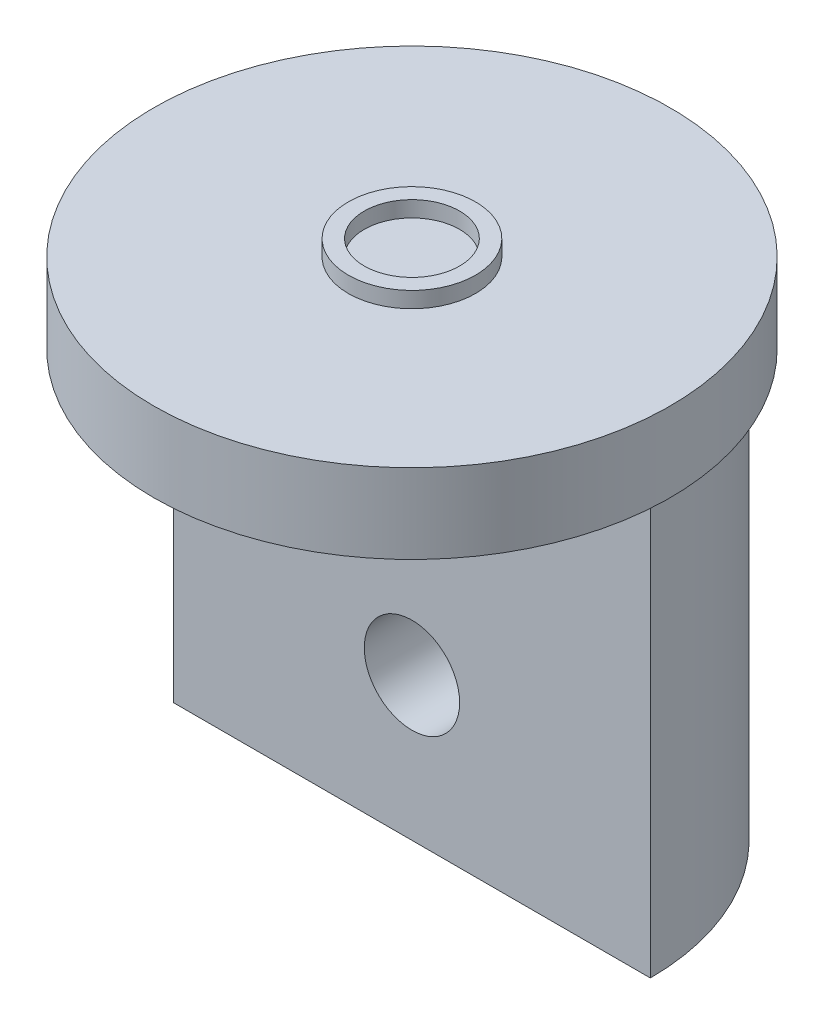
ISO-10303-21;
HEADER;
FILE_DESCRIPTION(('STEP AP214'),'2;1');
FILE_NAME('part.step','',(''),(''),'','','');
FILE_SCHEMA(('AUTOMOTIVE_DESIGN { 1 0 10303 214 1 1 1 1 }'));
ENDSEC;
DATA;
#1=APPLICATION_CONTEXT('core data for automotive mechanical design processes');
#2=APPLICATION_PROTOCOL_DEFINITION('international standard','automotive_design',2000,#1);
#3=PRODUCT_CONTEXT('',#1,'mechanical');
#4=PRODUCT('Part','Part','',(#3));
#5=PRODUCT_RELATED_PRODUCT_CATEGORY('part','',(#4));
#6=PRODUCT_DEFINITION_FORMATION('','',#4);
#7=PRODUCT_DEFINITION_CONTEXT('part definition',#1,'design');
#8=PRODUCT_DEFINITION('design','',#6,#7);
#9=PRODUCT_DEFINITION_SHAPE('','',#8);
#10=(LENGTH_UNIT() NAMED_UNIT(*) SI_UNIT(.MILLI.,.METRE.));
#11=(NAMED_UNIT(*) PLANE_ANGLE_UNIT() SI_UNIT($,.RADIAN.));
#12=(NAMED_UNIT(*) SI_UNIT($,.STERADIAN.) SOLID_ANGLE_UNIT());
#13=UNCERTAINTY_MEASURE_WITH_UNIT(LENGTH_MEASURE(1.E-05),#10,'distance_accuracy_value','');
#14=(GEOMETRIC_REPRESENTATION_CONTEXT(3) GLOBAL_UNCERTAINTY_ASSIGNED_CONTEXT((#13)) GLOBAL_UNIT_ASSIGNED_CONTEXT((#10,
#11,#12)) REPRESENTATION_CONTEXT('',''));
#15=CARTESIAN_POINT('',(0.,0.,0.));
#16=DIRECTION('',(0.,0.,1.));
#17=DIRECTION('',(1.,0.,0.));
#18=AXIS2_PLACEMENT_3D('',#15,#16,#17);
#19=CARTESIAN_POINT('',(0.,-63.5872,0.));
#20=DIRECTION('',(0.,0.,-1.));
#21=DIRECTION('',(-1.,0.,0.));
#22=AXIS2_PLACEMENT_3D('',#19,#20,#21);
#23=PLANE('',#22);
#24=CARTESIAN_POINT('',(0.,-45.5872,0.));
#25=DIRECTION('',(0.,0.,1.));
#26=DIRECTION('',(1.,0.,0.));
#27=AXIS2_PLACEMENT_3D('',#24,#25,#26);
#28=CIRCLE('',#27,6.);
#29=CARTESIAN_POINT('',(6.,-45.5872,0.));
#30=VERTEX_POINT('',#29);
#31=EDGE_CURVE('E93',#30,#30,#28,.T.);
#32=ORIENTED_EDGE('',*,*,#31,.F.);
#33=EDGE_LOOP('',(#32));
#34=FACE_BOUND('',#33,.T.);
#35=DIRECTION('',(-1.,0.,0.));
#36=VECTOR('',#35,1.);
#37=CARTESIAN_POINT('',(0.,-10.,0.));
#38=LINE('',#37,#36);
#39=CARTESIAN_POINT('',(30.,-10.,0.));
#40=VERTEX_POINT('',#39);
#41=CARTESIAN_POINT('',(-30.,-10.,0.));
#42=VERTEX_POINT('',#41);
#43=EDGE_CURVE('E57',#40,#42,#38,.T.);
#44=ORIENTED_EDGE('',*,*,#43,.T.);
#45=DIRECTION('',(0.,1.,0.));
#46=VECTOR('',#45,1.);
#47=CARTESIAN_POINT('',(-30.,-63.5872,0.));
#48=LINE('',#47,#46);
#49=CARTESIAN_POINT('',(-30.,-63.5872,0.));
#50=VERTEX_POINT('',#49);
#51=EDGE_CURVE('E74',#50,#42,#48,.T.);
#52=ORIENTED_EDGE('',*,*,#51,.F.);
#53=DIRECTION('',(-1.,0.,0.));
#54=VECTOR('',#53,1.);
#55=CARTESIAN_POINT('',(0.,-63.5872,0.));
#56=LINE('',#55,#54);
#57=CARTESIAN_POINT('',(30.,-63.5872,0.));
#58=VERTEX_POINT('',#57);
#59=EDGE_CURVE('E64',#58,#50,#56,.T.);
#60=ORIENTED_EDGE('',*,*,#59,.F.);
#61=DIRECTION('',(0.,1.,0.));
#62=VECTOR('',#61,1.);
#63=CARTESIAN_POINT('',(30.,-63.5872,0.));
#64=LINE('',#63,#62);
#65=EDGE_CURVE('E69',#58,#40,#64,.T.);
#66=ORIENTED_EDGE('',*,*,#65,.T.);
#67=EDGE_LOOP('',(#44,#52,#60,#66));
#68=FACE_BOUND('',#67,.T.);
#69=ADVANCED_FACE('F41',(#34,#68),#23,.F.);
#70=CARTESIAN_POINT('',(0.,-10.,0.));
#71=DIRECTION('',(0.,1.,0.));
#72=DIRECTION('',(0.,0.,1.));
#73=AXIS2_PLACEMENT_3D('',#70,#71,#72);
#74=CYLINDRICAL_SURFACE('',#73,32.5);
#75=CARTESIAN_POINT('',(0.,-10.,0.));
#76=DIRECTION('',(0.,1.,0.));
#77=DIRECTION('',(0.,0.,1.));
#78=AXIS2_PLACEMENT_3D('',#75,#76,#77);
#79=CIRCLE('',#78,32.5);
#80=CARTESIAN_POINT('',(0.,-10.,32.5));
#81=VERTEX_POINT('',#80);
#82=EDGE_CURVE('E50',#81,#81,#79,.T.);
#83=ORIENTED_EDGE('',*,*,#82,.T.);
#84=EDGE_LOOP('',(#83));
#85=FACE_BOUND('',#84,.T.);
#86=CARTESIAN_POINT('',(0.,0.,0.));
#87=DIRECTION('',(0.,1.,0.));
#88=DIRECTION('',(0.,0.,1.));
#89=AXIS2_PLACEMENT_3D('',#86,#87,#88);
#90=CIRCLE('',#89,32.5);
#91=CARTESIAN_POINT('',(0.,0.,32.5));
#92=VERTEX_POINT('',#91);
#93=EDGE_CURVE('E82',#92,#92,#90,.T.);
#94=ORIENTED_EDGE('',*,*,#93,.F.);
#95=EDGE_LOOP('',(#94));
#96=FACE_BOUND('',#95,.T.);
#97=ADVANCED_FACE('F43',(#85,#96),#74,.T.);
#98=CARTESIAN_POINT('',(0.,-10.,0.));
#99=DIRECTION('',(0.,1.,0.));
#100=DIRECTION('',(0.,0.,1.));
#101=AXIS2_PLACEMENT_3D('',#98,#99,#100);
#102=PLANE('',#101);
#103=CARTESIAN_POINT('',(0.,-10.,0.));
#104=DIRECTION('',(0.,1.,0.));
#105=DIRECTION('',(0.,0.,1.));
#106=AXIS2_PLACEMENT_3D('',#103,#104,#105);
#107=CIRCLE('',#106,30.);
#108=EDGE_CURVE('E78',#40,#42,#107,.T.);
#109=ORIENTED_EDGE('',*,*,#108,.T.);
#110=ORIENTED_EDGE('',*,*,#43,.F.);
#111=EDGE_LOOP('',(#109,#110));
#112=FACE_BOUND('',#111,.T.);
#113=ORIENTED_EDGE('',*,*,#82,.F.);
#114=EDGE_LOOP('',(#113));
#115=FACE_BOUND('',#114,.T.);
#116=ADVANCED_FACE('F84',(#112,#115),#102,.F.);
#117=CARTESIAN_POINT('',(0.,0.,0.));
#118=DIRECTION('',(0.,1.,0.));
#119=DIRECTION('',(0.,0.,1.));
#120=AXIS2_PLACEMENT_3D('',#117,#118,#119);
#121=PLANE('',#120);
#122=CARTESIAN_POINT('',(0.,0.,0.));
#123=DIRECTION('',(0.,1.,0.));
#124=DIRECTION('',(0.,0.,1.));
#125=AXIS2_PLACEMENT_3D('',#122,#123,#124);
#126=CIRCLE('',#125,8.);
#127=CARTESIAN_POINT('',(0.,0.,8.));
#128=VERTEX_POINT('',#127);
#129=EDGE_CURVE('E173',#128,#128,#126,.T.);
#130=ORIENTED_EDGE('',*,*,#129,.F.);
#131=EDGE_LOOP('',(#130));
#132=FACE_BOUND('',#131,.T.);
#133=ORIENTED_EDGE('',*,*,#93,.T.);
#134=EDGE_LOOP('',(#133));
#135=FACE_BOUND('',#134,.T.);
#136=ADVANCED_FACE('F127',(#132,#135),#121,.T.);
#137=CARTESIAN_POINT('',(0.,-63.5872,0.));
#138=DIRECTION('',(0.,1.,0.));
#139=DIRECTION('',(0.,0.,1.));
#140=AXIS2_PLACEMENT_3D('',#137,#138,#139);
#141=CYLINDRICAL_SURFACE('',#140,30.);
#142=CARTESIAN_POINT('',(6.,-45.5872,-29.3938769133981));
#143=CARTESIAN_POINT('',(6.00000333510614,-45.7539491317261,-29.393875096905));
#144=CARTESIAN_POINT('',(5.99304686885587,-45.9206566269355,-29.3952984818504));
#145=CARTESIAN_POINT('',(5.96528300149183,-46.2529163846163,-29.4009458431103));
#146=CARTESIAN_POINT('',(5.94447325865162,-46.4184684469945,-29.40517029291));
#147=CARTESIAN_POINT('',(5.88914931201488,-46.7472569582242,-29.4163000801468));
#148=CARTESIAN_POINT('',(5.85462796382056,-46.9104921538809,-29.4232068151401));
#149=CARTESIAN_POINT('',(5.7721394346217,-47.2334667131942,-29.4395002230684));
#150=CARTESIAN_POINT('',(5.72416730423297,-47.3932047666639,-29.4488878087902));
#151=CARTESIAN_POINT('',(5.61522748795583,-47.7077873685409,-29.4698539103105));
#152=CARTESIAN_POINT('',(5.5542778349152,-47.8626383683656,-29.4814293834603));
#153=CARTESIAN_POINT('',(5.41977382716697,-48.1666756496078,-29.5064523391392));
#154=CARTESIAN_POINT('',(5.34621482271147,-48.3158598164792,-29.5199005118891));
#155=CARTESIAN_POINT('',(5.18707511068997,-48.6074360065465,-29.54827876595));
#156=CARTESIAN_POINT('',(5.10149974711649,-48.7498310115571,-29.5632081876493));
#157=CARTESIAN_POINT('',(4.91886856337343,-49.0270093650341,-29.594143163833));
#158=CARTESIAN_POINT('',(4.82180845652764,-49.1617898434732,-29.6101491191652));
#159=CARTESIAN_POINT('',(4.61563131912603,-49.4244071485701,-29.6429919960716));
#160=CARTESIAN_POINT('',(4.50638045208952,-49.5521379432488,-29.659836726956));
#161=CARTESIAN_POINT('',(4.27752319485129,-49.798021148447,-29.6937060209025));
#162=CARTESIAN_POINT('',(4.15791298163718,-49.916169991429,-29.7107306483011));
#163=CARTESIAN_POINT('',(3.9092158779844,-50.1420035291532,-29.7444746075582));
#164=CARTESIAN_POINT('',(3.78013179944656,-50.24969130693,-29.761194028179));
#165=CARTESIAN_POINT('',(3.51327430785834,-50.4539388486554,-29.793874835481));
#166=CARTESIAN_POINT('',(3.37549771025503,-50.550494497227,-29.8098359405508));
#167=CARTESIAN_POINT('',(3.09103878904664,-50.7325111258314,-29.8406787849013));
#168=CARTESIAN_POINT('',(2.94429156962211,-50.8178724654346,-29.8555503702572));
#169=CARTESIAN_POINT('',(2.64391411223831,-50.9759417022605,-29.8836491327882));
#170=CARTESIAN_POINT('',(2.49028131943708,-51.0486448530539,-29.8968756926008));
#171=CARTESIAN_POINT('',(2.177319192135,-51.1807768785198,-29.9212946699489));
#172=CARTESIAN_POINT('',(2.01799241771446,-51.240211633837,-29.9324879882196));
#173=CARTESIAN_POINT('',(1.6947246068725,-51.3453991841868,-29.9525329465806));
#174=CARTESIAN_POINT('',(1.5307819183727,-51.3911470106462,-29.9613837361615));
#175=CARTESIAN_POINT('',(1.03829197647964,-51.5061772533003,-29.9838019698935));
#176=CARTESIAN_POINT('',(0.704557677096856,-51.5551482145282,-29.9935985518401));
#177=CARTESIAN_POINT('',(0.0336601737553892,-51.5965233602268,-30.001859896018));
#178=CARTESIAN_POINT('',(-0.303502696662613,-51.5889329955458,-30.0003257501982));
#179=CARTESIAN_POINT('',(-0.966838561001311,-51.5180382879344,-29.9862248786091));
#180=CARTESIAN_POINT('',(-1.29309968279394,-51.4555288958944,-29.9738155767179));
#181=CARTESIAN_POINT('',(-1.93039336262285,-51.2778110463948,-29.9395309548099));
#182=CARTESIAN_POINT('',(-2.24142531079924,-51.1626004803977,-29.9176552560511));
#183=CARTESIAN_POINT('',(-2.84171580478658,-50.8820194234654,-29.8666376732379));
#184=CARTESIAN_POINT('',(-3.13082478354466,-50.7163374033769,-29.837450866924));
#185=CARTESIAN_POINT('',(-3.67743053644734,-50.3397456265845,-29.7750281920193));
#186=CARTESIAN_POINT('',(-3.9349236677223,-50.1288306656858,-29.7417918577076));
#187=CARTESIAN_POINT('',(-4.41570851451839,-49.6633982426166,-29.6742578553619));
#188=CARTESIAN_POINT('',(-4.63832588020598,-49.4081848729989,-29.6399517856232));
#189=CARTESIAN_POINT('',(-5.03771097829702,-48.8637013519192,-29.5746942977534));
#190=CARTESIAN_POINT('',(-5.21447784350685,-48.5744305564624,-29.5437429430782));
#191=CARTESIAN_POINT('',(-5.51737688366216,-47.9690750072994,-29.488682847568));
#192=CARTESIAN_POINT('',(-5.6433998853611,-47.652934193736,-29.4645888924164));
#193=CARTESIAN_POINT('',(-5.84034205101878,-47.003372058203,-29.4261885783494));
#194=CARTESIAN_POINT('',(-5.91126839670819,-46.6699529944618,-29.4118809438372));
#195=CARTESIAN_POINT('',(-5.99499603624782,-46.0014108518293,-29.3949287559403));
#196=CARTESIAN_POINT('',(-6.00877115472193,-45.6664145539729,-29.392088822021));
#197=CARTESIAN_POINT('',(-5.98042576852842,-44.9989106609405,-29.3978691396608));
#198=CARTESIAN_POINT('',(-5.93830843342556,-44.6664029257178,-29.4064887413695));
#199=CARTESIAN_POINT('',(-5.80021325370489,-44.016588157828,-29.4340339503421));
#200=CARTESIAN_POINT('',(-5.70475574466207,-43.6991659402384,-29.4528599418081));
#201=CARTESIAN_POINT('',(-5.46324619222321,-43.0848203273747,-29.4986093601615));
#202=CARTESIAN_POINT('',(-5.31718998098505,-42.787898623156,-29.52553345407));
#203=CARTESIAN_POINT('',(-4.97642492750242,-42.2187213344535,-29.584884360869));
#204=CARTESIAN_POINT('',(-4.78110674652345,-41.9468377002483,-29.6173783235999));
#205=CARTESIAN_POINT('',(-4.34817315462066,-41.4393501499435,-29.6840234178912));
#206=CARTESIAN_POINT('',(-4.11055339041149,-41.2037499724583,-29.7181747197462));
#207=CARTESIAN_POINT('',(-3.59539469741514,-40.7718245616746,-29.7849207965064));
#208=CARTESIAN_POINT('',(-3.3172989644469,-40.5761577593257,-29.8174836292275));
#209=CARTESIAN_POINT('',(-2.73160340910619,-40.2343250237637,-29.8768274910177));
#210=CARTESIAN_POINT('',(-2.42400482646431,-40.088157011745,-29.9036087628785));
#211=CARTESIAN_POINT('',(-1.78983082568921,-39.8504256084325,-29.9482382625133));
#212=CARTESIAN_POINT('',(-1.46337490895416,-39.7585525688353,-29.9661370520399));
#213=CARTESIAN_POINT('',(-0.799081866603521,-39.6310568353035,-29.9911918530534));
#214=CARTESIAN_POINT('',(-0.461246116775197,-39.5954273664429,-29.9983491584209));
#215=CARTESIAN_POINT('',(0.0431170435291574,-39.5850395330863,-30.0004347718396));
#216=CARTESIAN_POINT('',(0.209457248283328,-39.5885492295881,-29.999729191723));
#217=CARTESIAN_POINT('',(0.541221900412231,-39.6093537510026,-29.9955746319066));
#218=CARTESIAN_POINT('',(0.706646671136065,-39.6266433478733,-29.9921266926485));
#219=CARTESIAN_POINT('',(1.03545948074028,-39.6748856357924,-29.982576859633));
#220=CARTESIAN_POINT('',(1.19884679403406,-39.7058430590127,-29.9764740466971));
#221=CARTESIAN_POINT('',(1.52232847740528,-39.7811618013874,-29.9617875659847));
#222=CARTESIAN_POINT('',(1.68242400285531,-39.825518328804,-29.9532047851327));
#223=CARTESIAN_POINT('',(1.99795666243994,-39.9272006104432,-29.9338121570394));
#224=CARTESIAN_POINT('',(2.15340222507818,-39.9845010577356,-29.9230066591157));
#225=CARTESIAN_POINT('',(2.45884588055595,-40.1116695072197,-29.8994570766236));
#226=CARTESIAN_POINT('',(2.60884588147142,-40.1815330553207,-29.8867136793595));
#227=CARTESIAN_POINT('',(2.90251338671477,-40.3333679404047,-29.8596244432042));
#228=CARTESIAN_POINT('',(3.04617825592765,-40.4153442551785,-29.8452779461062));
#229=CARTESIAN_POINT('',(3.32611433663683,-40.5907772711849,-29.8153781608729));
#230=CARTESIAN_POINT('',(3.46238806754744,-40.6842300245392,-29.7998252884034));
#231=CARTESIAN_POINT('',(3.72889132722776,-40.8836353209969,-29.7676616955118));
#232=CARTESIAN_POINT('',(3.85898398462975,-40.9897687051933,-29.7510377527238));
#233=CARTESIAN_POINT('',(4.10975159138331,-41.2124936831459,-29.717435014952));
#234=CARTESIAN_POINT('',(4.23042983300557,-41.329081589965,-29.7004563466747));
#235=CARTESIAN_POINT('',(4.4616785423051,-41.57203296824,-29.6665989281401));
#236=CARTESIAN_POINT('',(4.5722429213758,-41.6984022447337,-29.649720243717));
#237=CARTESIAN_POINT('',(4.78239003473628,-41.9599587545755,-29.6165504526653));
#238=CARTESIAN_POINT('',(4.88197678693908,-42.0951427326354,-29.6002591325348));
#239=CARTESIAN_POINT('',(5.07057246425824,-42.3750222713163,-29.5685397789357));
#240=CARTESIAN_POINT('',(5.15945073795087,-42.5198072459413,-29.5531234279088));
#241=CARTESIAN_POINT('',(5.32463866180646,-42.8164535419126,-29.5238083598846));
#242=CARTESIAN_POINT('',(5.40095294194388,-42.9683122299289,-29.5099090844669));
#243=CARTESIAN_POINT('',(5.54043652959129,-43.2780053386067,-29.4840397274659));
#244=CARTESIAN_POINT('',(5.6036138483902,-43.4358360475323,-29.4720684711326));
#245=CARTESIAN_POINT('',(5.71637667542989,-43.7563767977122,-29.4504044449586));
#246=CARTESIAN_POINT('',(5.76596481332563,-43.919085888176,-29.440711234343));
#247=CARTESIAN_POINT('',(5.87197100503538,-44.328661226159,-29.4197929724098));
#248=CARTESIAN_POINT('',(5.91991604198391,-44.5778535421825,-29.4101281711635));
#249=CARTESIAN_POINT('',(5.98392745666309,-45.0804627001748,-29.397171631295));
#250=CARTESIAN_POINT('',(5.9999949334003,-45.3338793962006,-29.3938796729635));
#251=CARTESIAN_POINT('',(6.,-45.5872,-29.3938769133981));
#252=B_SPLINE_CURVE_WITH_KNOTS('',3,(#142,#143,#144,#145,#146,#147,#148,#149,#150,#151,#152,
#153,#154,#155,#156,#157,#158,#159,#160,#161,#162,#163,#164,#165,#166,#167,#168,#169,#170,#171,
#172,#173,#174,#175,#176,#177,#178,#179,#180,#181,#182,#183,#184,#185,#186,#187,#188,#189,#190,
#191,#192,#193,#194,#195,#196,#197,#198,#199,#200,#201,#202,#203,#204,#205,#206,#207,#208,#209,
#210,#211,#212,#213,#214,#215,#216,#217,#218,#219,#220,#221,#222,#223,#224,#225,#226,#227,#228,
#229,#230,#231,#232,#233,#234,#235,#236,#237,#238,#239,#240,#241,#242,#243,#244,#245,#246,#247,
#248,#249,#250,#251),.UNSPECIFIED.,.T.,.F.,(4,2,2,2,2,2,2,2,2,2,2,2,2,2,2,2,2,2,2,2,2,2,2,2,2,2,
2,2,2,2,2,2,2,2,2,2,2,2,2,2,2,2,2,2,2,2,2,2,2,2,2,2,2,2,4),(0.,0.500024715606905,
1.00013397572718,1.50050415908842,2.00105870211202,2.50092218920769,3.0009704010183,
3.50079692837923,4.00081060781543,4.50698586276863,5.01334871910557,5.51956188696746,
6.02596159802115,6.53660041903647,7.04743030336698,7.55803333288037,8.06882149514346,
9.0758243333347,10.0827301273248,11.0752967783621,12.0679031447749,13.0667648536881,
14.0657415465538,15.0821302060989,16.0985380877131,17.1171211907313,18.1355715013431,
19.1365948686833,20.1375614721387,21.1289299074325,22.1203800216973,23.1247529869047,
24.1292293726459,25.1491255044404,26.1689787982397,27.1829582151524,28.1968154819311,
28.6954646798049,29.1939247820722,29.6925576002421,30.1910123098838,30.6885007877627,
31.185813233812,31.683330623798,32.1806773454224,32.6862322462992,33.1916095519823,
33.697289122723,34.2027829911743,34.7139260595868,35.2248803422918,35.7355221108972,
36.2460649948524,37.0057147077302,37.7653382305693),.UNSPECIFIED.);
#253=CARTESIAN_POINT('',(6.,-45.5872,-29.3938769133981));
#254=VERTEX_POINT('',#253);
#255=EDGE_CURVE('E87',#254,#254,#252,.T.);
#256=ORIENTED_EDGE('',*,*,#255,.F.);
#257=EDGE_LOOP('',(#256));
#258=FACE_BOUND('',#257,.T.);
#259=ORIENTED_EDGE('',*,*,#108,.F.);
#260=ORIENTED_EDGE('',*,*,#65,.F.);
#261=CARTESIAN_POINT('',(0.,-63.5872,0.));
#262=DIRECTION('',(0.,1.,0.));
#263=DIRECTION('',(0.,0.,1.));
#264=AXIS2_PLACEMENT_3D('',#261,#262,#263);
#265=CIRCLE('',#264,30.);
#266=EDGE_CURVE('E75',#58,#50,#265,.T.);
#267=ORIENTED_EDGE('',*,*,#266,.T.);
#268=ORIENTED_EDGE('',*,*,#51,.T.);
#269=EDGE_LOOP('',(#259,#260,#267,#268));
#270=FACE_BOUND('',#269,.T.);
#271=ADVANCED_FACE('F79',(#258,#270),#141,.T.);
#272=CARTESIAN_POINT('',(0.,-63.5872,0.));
#273=DIRECTION('',(0.,1.,0.));
#274=DIRECTION('',(0.,0.,1.));
#275=AXIS2_PLACEMENT_3D('',#272,#273,#274);
#276=PLANE('',#275);
#277=ORIENTED_EDGE('',*,*,#59,.T.);
#278=ORIENTED_EDGE('',*,*,#266,.F.);
#279=EDGE_LOOP('',(#277,#278));
#280=FACE_BOUND('',#279,.T.);
#281=ADVANCED_FACE('F119',(#280),#276,.F.);
#282=CARTESIAN_POINT('',(0.,-45.5872,-45.));
#283=DIRECTION('',(0.,0.,1.));
#284=DIRECTION('',(1.,0.,0.));
#285=AXIS2_PLACEMENT_3D('',#282,#283,#284);
#286=CYLINDRICAL_SURFACE('',#285,6.);
#287=ORIENTED_EDGE('',*,*,#255,.T.);
#288=EDGE_LOOP('',(#287));
#289=FACE_BOUND('',#288,.T.);
#290=ORIENTED_EDGE('',*,*,#31,.T.);
#291=EDGE_LOOP('',(#290));
#292=FACE_BOUND('',#291,.T.);
#293=ADVANCED_FACE('F114',(#289,#292),#286,.F.);
#294=CARTESIAN_POINT('',(0.,2.,0.));
#295=DIRECTION('',(0.,1.,0.));
#296=DIRECTION('',(0.,0.,1.));
#297=AXIS2_PLACEMENT_3D('',#294,#295,#296);
#298=PLANE('',#297);
#299=CARTESIAN_POINT('',(0.,2.,0.));
#300=DIRECTION('',(0.,1.,0.));
#301=DIRECTION('',(0.,0.,1.));
#302=AXIS2_PLACEMENT_3D('',#299,#300,#301);
#303=CIRCLE('',#302,8.);
#304=CARTESIAN_POINT('',(0.,2.,8.));
#305=VERTEX_POINT('',#304);
#306=EDGE_CURVE('E169',#305,#305,#303,.T.);
#307=ORIENTED_EDGE('',*,*,#306,.T.);
#308=EDGE_LOOP('',(#307));
#309=FACE_BOUND('',#308,.T.);
#310=CARTESIAN_POINT('',(0.,2.,0.));
#311=DIRECTION('',(0.,1.,0.));
#312=DIRECTION('',(0.,0.,1.));
#313=AXIS2_PLACEMENT_3D('',#310,#311,#312);
#314=CIRCLE('',#313,6.);
#315=CARTESIAN_POINT('',(0.,2.,6.));
#316=VERTEX_POINT('',#315);
#317=EDGE_CURVE('E171',#316,#316,#314,.T.);
#318=ORIENTED_EDGE('',*,*,#317,.F.);
#319=EDGE_LOOP('',(#318));
#320=FACE_BOUND('',#319,.T.);
#321=ADVANCED_FACE('F118',(#309,#320),#298,.T.);
#322=CARTESIAN_POINT('',(0.,2.,0.));
#323=DIRECTION('',(0.,-1.,0.));
#324=DIRECTION('',(0.,0.,-1.));
#325=AXIS2_PLACEMENT_3D('',#322,#323,#324);
#326=CYLINDRICAL_SURFACE('',#325,8.);
#327=ORIENTED_EDGE('',*,*,#306,.F.);
#328=EDGE_LOOP('',(#327));
#329=FACE_BOUND('',#328,.T.);
#330=ORIENTED_EDGE('',*,*,#129,.T.);
#331=EDGE_LOOP('',(#330));
#332=FACE_BOUND('',#331,.T.);
#333=ADVANCED_FACE('F121',(#329,#332),#326,.T.);
#334=CARTESIAN_POINT('',(0.,2.,0.));
#335=DIRECTION('',(0.,-1.,0.));
#336=DIRECTION('',(0.,0.,-1.));
#337=AXIS2_PLACEMENT_3D('',#334,#335,#336);
#338=CYLINDRICAL_SURFACE('',#337,6.);
#339=ORIENTED_EDGE('',*,*,#317,.T.);
#340=EDGE_LOOP('',(#339));
#341=FACE_BOUND('',#340,.T.);
#342=CARTESIAN_POINT('',(0.,0.,0.));
#343=DIRECTION('',(0.,1.,0.));
#344=DIRECTION('',(0.,0.,1.));
#345=AXIS2_PLACEMENT_3D('',#342,#343,#344);
#346=CIRCLE('',#345,6.);
#347=CARTESIAN_POINT('',(0.,0.,6.));
#348=VERTEX_POINT('',#347);
#349=EDGE_CURVE('E11',#348,#348,#346,.F.);
#350=ORIENTED_EDGE('',*,*,#349,.T.);
#351=EDGE_LOOP('',(#350));
#352=FACE_BOUND('',#351,.T.);
#353=ADVANCED_FACE('F148',(#341,#352),#338,.F.);
#354=ORIENTED_EDGE('',*,*,#349,.F.);
#355=EDGE_LOOP('',(#354));
#356=FACE_BOUND('',#355,.T.);
#357=ADVANCED_FACE('F140',(#356),#121,.T.);
#358=CLOSED_SHELL('',(#69,#97,#116,#136,#271,#281,#293,#321,#333,#353,#357));
#359=MANIFOLD_SOLID_BREP('B2',#358);
#360=ADVANCED_BREP_SHAPE_REPRESENTATION('',(#18,#359),#14);
#361=SHAPE_DEFINITION_REPRESENTATION(#9,#360);
ENDSEC;
END-ISO-10303-21;
